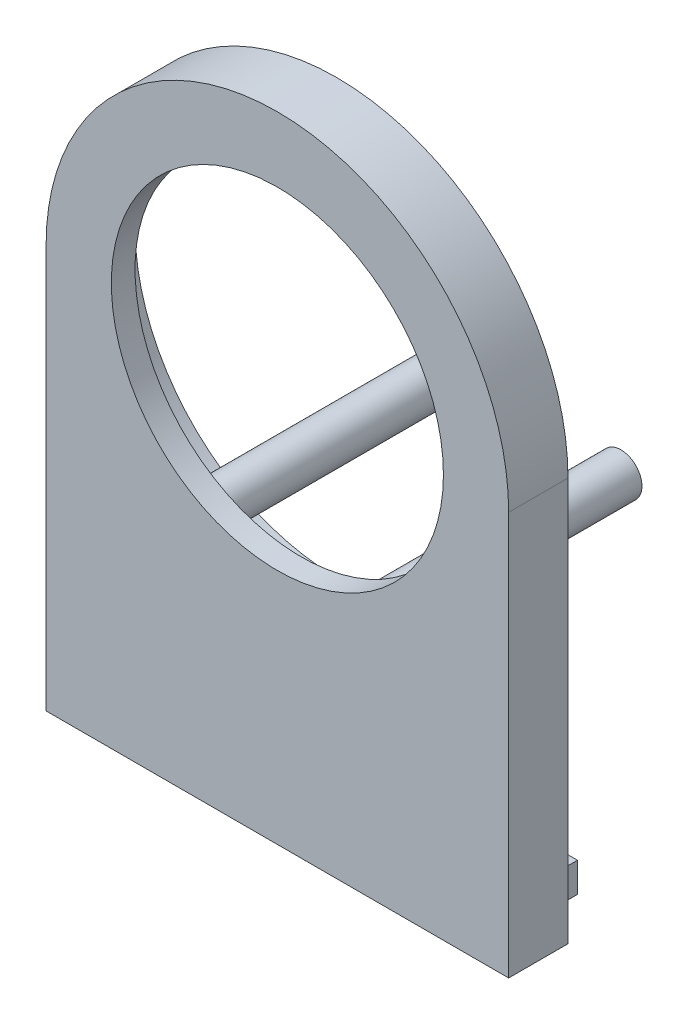
ISO-10303-21;
HEADER;
FILE_DESCRIPTION(('STEP AP214'),'2;1');
FILE_NAME('part.step','',(''),(''),'','','');
FILE_SCHEMA(('AUTOMOTIVE_DESIGN { 1 0 10303 214 1 1 1 1 }'));
ENDSEC;
DATA;
#1=APPLICATION_CONTEXT('core data for automotive mechanical design processes');
#2=APPLICATION_PROTOCOL_DEFINITION('international standard','automotive_design',2000,#1);
#3=PRODUCT_CONTEXT('',#1,'mechanical');
#4=PRODUCT('Part','Part','',(#3));
#5=PRODUCT_RELATED_PRODUCT_CATEGORY('part','',(#4));
#6=PRODUCT_DEFINITION_FORMATION('','',#4);
#7=PRODUCT_DEFINITION_CONTEXT('part definition',#1,'design');
#8=PRODUCT_DEFINITION('design','',#6,#7);
#9=PRODUCT_DEFINITION_SHAPE('','',#8);
#10=(LENGTH_UNIT() NAMED_UNIT(*) SI_UNIT(.MILLI.,.METRE.));
#11=(NAMED_UNIT(*) PLANE_ANGLE_UNIT() SI_UNIT($,.RADIAN.));
#12=(NAMED_UNIT(*) SI_UNIT($,.STERADIAN.) SOLID_ANGLE_UNIT());
#13=UNCERTAINTY_MEASURE_WITH_UNIT(LENGTH_MEASURE(1.E-05),#10,'distance_accuracy_value','');
#14=(GEOMETRIC_REPRESENTATION_CONTEXT(3) GLOBAL_UNCERTAINTY_ASSIGNED_CONTEXT((#13)) GLOBAL_UNIT_ASSIGNED_CONTEXT((#10,
#11,#12)) REPRESENTATION_CONTEXT('',''));
#15=CARTESIAN_POINT('',(0.,0.,0.));
#16=DIRECTION('',(0.,0.,1.));
#17=DIRECTION('',(1.,0.,0.));
#18=AXIS2_PLACEMENT_3D('',#15,#16,#17);
#19=CARTESIAN_POINT('',(0.,0.,-12.7));
#20=DIRECTION('',(0.,0.,1.));
#21=DIRECTION('',(1.,0.,0.));
#22=AXIS2_PLACEMENT_3D('',#19,#20,#21);
#23=CYLINDRICAL_SURFACE('',#22,43.18);
#24=CARTESIAN_POINT('',(0.,0.,-12.7));
#25=DIRECTION('',(0.,0.,1.));
#26=DIRECTION('',(1.,0.,0.));
#27=AXIS2_PLACEMENT_3D('',#24,#25,#26);
#28=CIRCLE('',#27,43.18);
#29=CARTESIAN_POINT('',(-16.7456882368897,-39.8006824749639,-12.7));
#30=VERTEX_POINT('',#29);
#31=CARTESIAN_POINT('',(15.1265083489331,-40.4438023085078,-12.7));
#32=VERTEX_POINT('',#31);
#33=EDGE_CURVE('E64',#30,#32,#28,.T.);
#34=ORIENTED_EDGE('',*,*,#33,.F.);
#35=DIRECTION('',(0.,0.,-1.));
#36=VECTOR('',#35,1.);
#37=CARTESIAN_POINT('',(-16.7456882368897,-39.8006824749638,-29.845));
#38=LINE('',#37,#36);
#39=CARTESIAN_POINT('',(-16.7456882368897,-39.8006824749639,-5.08));
#40=VERTEX_POINT('',#39);
#41=EDGE_CURVE('E11',#30,#40,#38,.F.);
#42=ORIENTED_EDGE('',*,*,#41,.T.);
#43=CARTESIAN_POINT('',(0.,0.,-5.08));
#44=DIRECTION('',(0.,0.,1.));
#45=DIRECTION('',(1.,0.,0.));
#46=AXIS2_PLACEMENT_3D('',#43,#44,#45);
#47=CIRCLE('',#46,43.18);
#48=CARTESIAN_POINT('',(15.1265083489331,-40.4438023085078,-5.08));
#49=VERTEX_POINT('',#48);
#50=EDGE_CURVE('E138',#40,#49,#47,.T.);
#51=ORIENTED_EDGE('',*,*,#50,.T.);
#52=DIRECTION('',(0.,0.,-1.));
#53=VECTOR('',#52,1.);
#54=CARTESIAN_POINT('',(15.1265083489331,-40.4438023085078,-29.845));
#55=LINE('',#54,#53);
#56=EDGE_CURVE('E145',#49,#32,#55,.T.);
#57=ORIENTED_EDGE('',*,*,#56,.T.);
#58=EDGE_LOOP('',(#34,#42,#51,#57));
#59=FACE_BOUND('',#58,.T.);
#60=ADVANCED_FACE('F41',(#59),#23,.F.);
#61=CARTESIAN_POINT('',(0.,0.,-12.7));
#62=DIRECTION('',(0.,0.,1.));
#63=DIRECTION('',(1.,0.,0.));
#64=AXIS2_PLACEMENT_3D('',#61,#62,#63);
#65=PLANE('',#64);
#66=CARTESIAN_POINT('',(22.1824181320942,-37.0466290748961,-12.7));
#67=VERTEX_POINT('',#66);
#68=CARTESIAN_POINT('',(-24.4029508261512,-35.6231440355347,-12.7));
#69=VERTEX_POINT('',#68);
#70=EDGE_CURVE('E166',#67,#69,#28,.T.);
#71=ORIENTED_EDGE('',*,*,#70,.T.);
#72=CARTESIAN_POINT('',(-20.0525315885768,-36.7554966111032,-12.7));
#73=DIRECTION('',(0.,0.,1.));
#74=DIRECTION('',(1.,0.,0.));
#75=AXIS2_PLACEMENT_3D('',#72,#73,#74);
#76=CIRCLE('',#75,4.49537205335151);
#77=EDGE_CURVE('E57',#69,#30,#76,.T.);
#78=ORIENTED_EDGE('',*,*,#77,.T.);
#79=ORIENTED_EDGE('',*,*,#33,.T.);
#80=CARTESIAN_POINT('',(17.6964832477496,-36.7554966111032,-12.7));
#81=DIRECTION('',(0.,0.,1.));
#82=DIRECTION('',(1.,0.,0.));
#83=AXIS2_PLACEMENT_3D('',#80,#81,#82);
#84=CIRCLE('',#83,4.49537205335151);
#85=EDGE_CURVE('E248',#32,#67,#84,.T.);
#86=ORIENTED_EDGE('',*,*,#85,.T.);
#87=EDGE_LOOP('',(#71,#78,#79,#86));
#88=FACE_BOUND('',#87,.T.);
#89=DIRECTION('',(0.,-1.,0.));
#90=VECTOR('',#89,1.);
#91=CARTESIAN_POINT('',(41.402,0.,-12.7));
#92=LINE('',#91,#90);
#93=CARTESIAN_POINT('',(41.402,-80.01,-12.7));
#94=VERTEX_POINT('',#93);
#95=CARTESIAN_POINT('',(41.402,-86.36,-12.7));
#96=VERTEX_POINT('',#95);
#97=EDGE_CURVE('E234',#94,#96,#92,.T.);
#98=ORIENTED_EDGE('',*,*,#97,.F.);
#99=DIRECTION('',(-1.,0.,0.));
#100=VECTOR('',#99,1.);
#101=CARTESIAN_POINT('',(41.402,-80.01,-12.7));
#102=LINE('',#101,#100);
#103=CARTESIAN_POINT('',(-49.53,-80.01,-12.7));
#104=VERTEX_POINT('',#103);
#105=EDGE_CURVE('E220',#94,#104,#102,.T.);
#106=ORIENTED_EDGE('',*,*,#105,.T.);
#107=DIRECTION('',(0.,-1.,0.));
#108=VECTOR('',#107,1.);
#109=CARTESIAN_POINT('',(-49.53,0.,-12.7));
#110=LINE('',#109,#108);
#111=CARTESIAN_POINT('',(-49.53,0.,-12.7));
#112=VERTEX_POINT('',#111);
#113=EDGE_CURVE('E201',#112,#104,#110,.T.);
#114=ORIENTED_EDGE('',*,*,#113,.F.);
#115=CARTESIAN_POINT('',(0.,0.,-12.7));
#116=DIRECTION('',(0.,0.,1.));
#117=DIRECTION('',(1.,0.,0.));
#118=AXIS2_PLACEMENT_3D('',#115,#116,#117);
#119=CIRCLE('',#118,49.53);
#120=CARTESIAN_POINT('',(49.53,0.,-12.7));
#121=VERTEX_POINT('',#120);
#122=EDGE_CURVE('E158',#121,#112,#119,.T.);
#123=ORIENTED_EDGE('',*,*,#122,.F.);
#124=DIRECTION('',(0.,-1.,0.));
#125=VECTOR('',#124,1.);
#126=CARTESIAN_POINT('',(49.53,0.,-12.7));
#127=LINE('',#126,#125);
#128=CARTESIAN_POINT('',(49.53,-86.36,-12.7));
#129=VERTEX_POINT('',#128);
#130=EDGE_CURVE('E208',#121,#129,#127,.T.);
#131=ORIENTED_EDGE('',*,*,#130,.T.);
#132=DIRECTION('',(-1.,0.,0.));
#133=VECTOR('',#132,1.);
#134=CARTESIAN_POINT('',(0.,-86.36,-12.7));
#135=LINE('',#134,#133);
#136=EDGE_CURVE('E213',#129,#96,#135,.T.);
#137=ORIENTED_EDGE('',*,*,#136,.T.);
#138=EDGE_LOOP('',(#98,#106,#114,#123,#131,#137));
#139=FACE_BOUND('',#138,.T.);
#140=ADVANCED_FACE('F288',(#88,#139),#65,.F.);
#141=CARTESIAN_POINT('',(0.,0.,-5.08));
#142=DIRECTION('',(0.,0.,1.));
#143=DIRECTION('',(1.,0.,0.));
#144=AXIS2_PLACEMENT_3D('',#141,#142,#143);
#145=CYLINDRICAL_SURFACE('',#144,35.56);
#146=CARTESIAN_POINT('',(0.,0.,-5.08));
#147=DIRECTION('',(0.,0.,1.));
#148=DIRECTION('',(1.,0.,0.));
#149=AXIS2_PLACEMENT_3D('',#146,#147,#148);
#150=CIRCLE('',#149,35.56);
#151=CARTESIAN_POINT('',(35.56,0.,-5.08));
#152=VERTEX_POINT('',#151);
#153=EDGE_CURVE('E151',#152,#152,#150,.T.);
#154=ORIENTED_EDGE('',*,*,#153,.F.);
#155=EDGE_LOOP('',(#154));
#156=FACE_BOUND('',#155,.T.);
#157=CARTESIAN_POINT('',(0.,0.,0.));
#158=DIRECTION('',(0.,0.,1.));
#159=DIRECTION('',(1.,0.,0.));
#160=AXIS2_PLACEMENT_3D('',#157,#158,#159);
#161=CIRCLE('',#160,35.56);
#162=CARTESIAN_POINT('',(35.56,0.,0.));
#163=VERTEX_POINT('',#162);
#164=EDGE_CURVE('E155',#163,#163,#161,.T.);
#165=ORIENTED_EDGE('',*,*,#164,.T.);
#166=EDGE_LOOP('',(#165));
#167=FACE_BOUND('',#166,.T.);
#168=ADVANCED_FACE('F43',(#156,#167),#145,.F.);
#169=CARTESIAN_POINT('',(0.,0.,-5.08));
#170=DIRECTION('',(0.,0.,1.));
#171=DIRECTION('',(1.,0.,0.));
#172=AXIS2_PLACEMENT_3D('',#169,#170,#171);
#173=PLANE('',#172);
#174=ORIENTED_EDGE('',*,*,#153,.T.);
#175=EDGE_LOOP('',(#174));
#176=FACE_BOUND('',#175,.T.);
#177=ORIENTED_EDGE('',*,*,#50,.F.);
#178=CARTESIAN_POINT('',(-20.0525315885768,-36.7554966111032,-5.08));
#179=DIRECTION('',(0.,0.,1.));
#180=DIRECTION('',(1.,0.,0.));
#181=AXIS2_PLACEMENT_3D('',#178,#179,#180);
#182=CIRCLE('',#181,4.49537205335151);
#183=CARTESIAN_POINT('',(-24.4029508261511,-35.6231440355347,-5.08));
#184=VERTEX_POINT('',#183);
#185=EDGE_CURVE('E125',#40,#184,#182,.T.);
#186=ORIENTED_EDGE('',*,*,#185,.T.);
#187=CARTESIAN_POINT('',(22.1824181320942,-37.0466290748961,-5.08));
#188=VERTEX_POINT('',#187);
#189=EDGE_CURVE('E137',#188,#184,#47,.T.);
#190=ORIENTED_EDGE('',*,*,#189,.F.);
#191=CARTESIAN_POINT('',(17.6964832477496,-36.7554966111032,-5.08));
#192=DIRECTION('',(0.,0.,1.));
#193=DIRECTION('',(1.,0.,0.));
#194=AXIS2_PLACEMENT_3D('',#191,#192,#193);
#195=CIRCLE('',#194,4.49537205335151);
#196=EDGE_CURVE('E261',#188,#49,#195,.T.);
#197=ORIENTED_EDGE('',*,*,#196,.T.);
#198=EDGE_LOOP('',(#177,#186,#190,#197));
#199=FACE_BOUND('',#198,.T.);
#200=ADVANCED_FACE('F135',(#176,#199),#173,.F.);
#201=CARTESIAN_POINT('',(0.,0.,0.));
#202=DIRECTION('',(0.,0.,1.));
#203=DIRECTION('',(1.,0.,0.));
#204=AXIS2_PLACEMENT_3D('',#201,#202,#203);
#205=PLANE('',#204);
#206=ORIENTED_EDGE('',*,*,#164,.F.);
#207=EDGE_LOOP('',(#206));
#208=FACE_BOUND('',#207,.T.);
#209=CARTESIAN_POINT('',(0.,0.,0.));
#210=DIRECTION('',(0.,0.,1.));
#211=DIRECTION('',(1.,0.,0.));
#212=AXIS2_PLACEMENT_3D('',#209,#210,#211);
#213=CIRCLE('',#212,49.53);
#214=CARTESIAN_POINT('',(49.53,0.,0.));
#215=VERTEX_POINT('',#214);
#216=CARTESIAN_POINT('',(-49.53,0.,0.));
#217=VERTEX_POINT('',#216);
#218=EDGE_CURVE('E174',#215,#217,#213,.T.);
#219=ORIENTED_EDGE('',*,*,#218,.T.);
#220=DIRECTION('',(0.,-1.,0.));
#221=VECTOR('',#220,1.);
#222=CARTESIAN_POINT('',(-49.53,0.,0.));
#223=LINE('',#222,#221);
#224=CARTESIAN_POINT('',(-49.53,-86.36,0.));
#225=VERTEX_POINT('',#224);
#226=EDGE_CURVE('E193',#217,#225,#223,.T.);
#227=ORIENTED_EDGE('',*,*,#226,.T.);
#228=DIRECTION('',(-1.,0.,0.));
#229=VECTOR('',#228,1.);
#230=CARTESIAN_POINT('',(0.,-86.36,0.));
#231=LINE('',#230,#229);
#232=CARTESIAN_POINT('',(49.53,-86.36,0.));
#233=VERTEX_POINT('',#232);
#234=EDGE_CURVE('E217',#233,#225,#231,.T.);
#235=ORIENTED_EDGE('',*,*,#234,.F.);
#236=DIRECTION('',(0.,-1.,0.));
#237=VECTOR('',#236,1.);
#238=CARTESIAN_POINT('',(49.53,0.,0.));
#239=LINE('',#238,#237);
#240=EDGE_CURVE('E219',#215,#233,#239,.T.);
#241=ORIENTED_EDGE('',*,*,#240,.F.);
#242=EDGE_LOOP('',(#219,#227,#235,#241));
#243=FACE_BOUND('',#242,.T.);
#244=ADVANCED_FACE('F299',(#208,#243),#205,.T.);
#245=ORIENTED_EDGE('',*,*,#189,.T.);
#246=DIRECTION('',(0.,0.,-1.));
#247=VECTOR('',#246,1.);
#248=CARTESIAN_POINT('',(-24.4029508261511,-35.6231440355347,-29.845));
#249=LINE('',#248,#247);
#250=EDGE_CURVE('E50',#184,#69,#249,.T.);
#251=ORIENTED_EDGE('',*,*,#250,.T.);
#252=ORIENTED_EDGE('',*,*,#70,.F.);
#253=DIRECTION('',(0.,0.,-1.));
#254=VECTOR('',#253,1.);
#255=CARTESIAN_POINT('',(22.1824181320942,-37.0466290748961,-29.845));
#256=LINE('',#255,#254);
#257=EDGE_CURVE('E131',#67,#188,#256,.F.);
#258=ORIENTED_EDGE('',*,*,#257,.T.);
#259=EDGE_LOOP('',(#245,#251,#252,#258));
#260=FACE_BOUND('',#259,.T.);
#261=ADVANCED_FACE('F143',(#260),#23,.F.);
#262=CARTESIAN_POINT('',(0.,0.,-12.7));
#263=DIRECTION('',(0.,0.,1.));
#264=DIRECTION('',(1.,0.,0.));
#265=AXIS2_PLACEMENT_3D('',#262,#263,#264);
#266=CYLINDRICAL_SURFACE('',#265,49.53);
#267=DIRECTION('',(0.,0.,1.));
#268=VECTOR('',#267,1.);
#269=CARTESIAN_POINT('',(-49.53,0.,-12.7));
#270=LINE('',#269,#268);
#271=EDGE_CURVE('E184',#112,#217,#270,.T.);
#272=ORIENTED_EDGE('',*,*,#271,.T.);
#273=ORIENTED_EDGE('',*,*,#218,.F.);
#274=DIRECTION('',(0.,0.,1.));
#275=VECTOR('',#274,1.);
#276=CARTESIAN_POINT('',(49.53,0.,-12.7));
#277=LINE('',#276,#275);
#278=EDGE_CURVE('E190',#121,#215,#277,.T.);
#279=ORIENTED_EDGE('',*,*,#278,.F.);
#280=ORIENTED_EDGE('',*,*,#122,.T.);
#281=EDGE_LOOP('',(#272,#273,#279,#280));
#282=FACE_BOUND('',#281,.T.);
#283=ADVANCED_FACE('F298',(#282),#266,.T.);
#284=CARTESIAN_POINT('',(0.,-86.36,-12.7));
#285=DIRECTION('',(0.,1.,0.));
#286=DIRECTION('',(0.,0.,1.));
#287=AXIS2_PLACEMENT_3D('',#284,#285,#286);
#288=PLANE('',#287);
#289=ORIENTED_EDGE('',*,*,#234,.T.);
#290=DIRECTION('',(0.,0.,1.));
#291=VECTOR('',#290,1.);
#292=CARTESIAN_POINT('',(-49.53,-86.36,-12.7));
#293=LINE('',#292,#291);
#294=CARTESIAN_POINT('',(-49.53,-86.36,-22.86));
#295=VERTEX_POINT('',#294);
#296=EDGE_CURVE('E177',#295,#225,#293,.T.);
#297=ORIENTED_EDGE('',*,*,#296,.F.);
#298=DIRECTION('',(-1.,0.,0.));
#299=VECTOR('',#298,1.);
#300=CARTESIAN_POINT('',(41.402,-86.36,-22.86));
#301=LINE('',#300,#299);
#302=CARTESIAN_POINT('',(41.402,-86.36,-22.86));
#303=VERTEX_POINT('',#302);
#304=EDGE_CURVE('E233',#303,#295,#301,.T.);
#305=ORIENTED_EDGE('',*,*,#304,.F.);
#306=DIRECTION('',(0.,0.,-1.));
#307=VECTOR('',#306,1.);
#308=CARTESIAN_POINT('',(41.402,-86.36,0.));
#309=LINE('',#308,#307);
#310=EDGE_CURVE('E251',#96,#303,#309,.T.);
#311=ORIENTED_EDGE('',*,*,#310,.F.);
#312=ORIENTED_EDGE('',*,*,#136,.F.);
#313=DIRECTION('',(0.,0.,1.));
#314=VECTOR('',#313,1.);
#315=CARTESIAN_POINT('',(49.53,-86.36,-12.7));
#316=LINE('',#315,#314);
#317=EDGE_CURVE('E198',#129,#233,#316,.T.);
#318=ORIENTED_EDGE('',*,*,#317,.T.);
#319=EDGE_LOOP('',(#289,#297,#305,#311,#312,#318));
#320=FACE_BOUND('',#319,.T.);
#321=ADVANCED_FACE('F304',(#320),#288,.F.);
#322=CARTESIAN_POINT('',(-49.53,0.,-12.7));
#323=DIRECTION('',(-1.,0.,0.));
#324=DIRECTION('',(0.,0.,1.));
#325=AXIS2_PLACEMENT_3D('',#322,#323,#324);
#326=PLANE('',#325);
#327=ORIENTED_EDGE('',*,*,#226,.F.);
#328=ORIENTED_EDGE('',*,*,#271,.F.);
#329=ORIENTED_EDGE('',*,*,#113,.T.);
#330=DIRECTION('',(0.,0.,1.));
#331=VECTOR('',#330,1.);
#332=CARTESIAN_POINT('',(-49.53,-80.01,0.));
#333=LINE('',#332,#331);
#334=CARTESIAN_POINT('',(-49.53,-80.01,-22.86));
#335=VERTEX_POINT('',#334);
#336=EDGE_CURVE('E245',#335,#104,#333,.T.);
#337=ORIENTED_EDGE('',*,*,#336,.F.);
#338=DIRECTION('',(0.,1.,0.));
#339=VECTOR('',#338,1.);
#340=CARTESIAN_POINT('',(-49.53,0.,-22.86));
#341=LINE('',#340,#339);
#342=EDGE_CURVE('E241',#295,#335,#341,.T.);
#343=ORIENTED_EDGE('',*,*,#342,.F.);
#344=ORIENTED_EDGE('',*,*,#296,.T.);
#345=EDGE_LOOP('',(#327,#328,#329,#337,#343,#344));
#346=FACE_BOUND('',#345,.T.);
#347=ADVANCED_FACE('F395',(#346),#326,.T.);
#348=CARTESIAN_POINT('',(49.53,0.,-12.7));
#349=DIRECTION('',(-1.,0.,0.));
#350=DIRECTION('',(0.,0.,1.));
#351=AXIS2_PLACEMENT_3D('',#348,#349,#350);
#352=PLANE('',#351);
#353=ORIENTED_EDGE('',*,*,#240,.T.);
#354=ORIENTED_EDGE('',*,*,#317,.F.);
#355=ORIENTED_EDGE('',*,*,#130,.F.);
#356=ORIENTED_EDGE('',*,*,#278,.T.);
#357=EDGE_LOOP('',(#353,#354,#355,#356));
#358=FACE_BOUND('',#357,.T.);
#359=ADVANCED_FACE('F386',(#358),#352,.F.);
#360=CARTESIAN_POINT('',(41.402,-80.01,0.));
#361=DIRECTION('',(0.,-1.,0.));
#362=DIRECTION('',(0.,0.,-1.));
#363=AXIS2_PLACEMENT_3D('',#360,#361,#362);
#364=PLANE('',#363);
#365=ORIENTED_EDGE('',*,*,#336,.T.);
#366=ORIENTED_EDGE('',*,*,#105,.F.);
#367=DIRECTION('',(0.,0.,1.));
#368=VECTOR('',#367,1.);
#369=CARTESIAN_POINT('',(41.402,-80.01,0.));
#370=LINE('',#369,#368);
#371=CARTESIAN_POINT('',(41.402,-80.01,-22.86));
#372=VERTEX_POINT('',#371);
#373=EDGE_CURVE('E244',#372,#94,#370,.T.);
#374=ORIENTED_EDGE('',*,*,#373,.F.);
#375=DIRECTION('',(-1.,0.,0.));
#376=VECTOR('',#375,1.);
#377=CARTESIAN_POINT('',(41.402,-80.01,-22.86));
#378=LINE('',#377,#376);
#379=EDGE_CURVE('E229',#372,#335,#378,.T.);
#380=ORIENTED_EDGE('',*,*,#379,.T.);
#381=EDGE_LOOP('',(#365,#366,#374,#380));
#382=FACE_BOUND('',#381,.T.);
#383=ADVANCED_FACE('F378',(#382),#364,.F.);
#384=CARTESIAN_POINT('',(41.402,0.,-22.86));
#385=DIRECTION('',(0.,0.,1.));
#386=DIRECTION('',(1.,0.,0.));
#387=AXIS2_PLACEMENT_3D('',#384,#385,#386);
#388=PLANE('',#387);
#389=ORIENTED_EDGE('',*,*,#342,.T.);
#390=ORIENTED_EDGE('',*,*,#379,.F.);
#391=DIRECTION('',(0.,1.,0.));
#392=VECTOR('',#391,1.);
#393=CARTESIAN_POINT('',(41.402,0.,-22.86));
#394=LINE('',#393,#392);
#395=EDGE_CURVE('E254',#303,#372,#394,.T.);
#396=ORIENTED_EDGE('',*,*,#395,.F.);
#397=ORIENTED_EDGE('',*,*,#304,.T.);
#398=EDGE_LOOP('',(#389,#390,#396,#397));
#399=FACE_BOUND('',#398,.T.);
#400=ADVANCED_FACE('F370',(#399),#388,.F.);
#401=CARTESIAN_POINT('',(41.402,0.,0.));
#402=DIRECTION('',(-1.,0.,0.));
#403=DIRECTION('',(0.,0.,1.));
#404=AXIS2_PLACEMENT_3D('',#401,#402,#403);
#405=PLANE('',#404);
#406=ORIENTED_EDGE('',*,*,#373,.T.);
#407=ORIENTED_EDGE('',*,*,#97,.T.);
#408=ORIENTED_EDGE('',*,*,#310,.T.);
#409=ORIENTED_EDGE('',*,*,#395,.T.);
#410=EDGE_LOOP('',(#406,#407,#408,#409));
#411=FACE_BOUND('',#410,.T.);
#412=ADVANCED_FACE('F346',(#411),#405,.F.);
#413=CARTESIAN_POINT('',(17.6964832477496,-36.7554966111032,-3.81));
#414=DIRECTION('',(0.,0.,-1.));
#415=DIRECTION('',(-1.,0.,0.));
#416=AXIS2_PLACEMENT_3D('',#413,#414,#415);
#417=CYLINDRICAL_SURFACE('',#416,4.49537205335151);
#418=CARTESIAN_POINT('',(17.6964832477496,-36.7554966111032,-55.88));
#419=DIRECTION('',(0.,0.,-1.));
#420=DIRECTION('',(-1.,0.,0.));
#421=AXIS2_PLACEMENT_3D('',#418,#419,#420);
#422=CIRCLE('',#421,4.49537205335151);
#423=CARTESIAN_POINT('',(13.2011111943981,-36.7554966111032,-55.88));
#424=VERTEX_POINT('',#423);
#425=EDGE_CURVE('E264',#424,#424,#422,.T.);
#426=ORIENTED_EDGE('',*,*,#425,.F.);
#427=EDGE_LOOP('',(#426));
#428=FACE_BOUND('',#427,.T.);
#429=ORIENTED_EDGE('',*,*,#257,.F.);
#430=ORIENTED_EDGE('',*,*,#85,.F.);
#431=ORIENTED_EDGE('',*,*,#56,.F.);
#432=ORIENTED_EDGE('',*,*,#196,.F.);
#433=EDGE_LOOP('',(#429,#430,#431,#432));
#434=FACE_BOUND('',#433,.T.);
#435=ADVANCED_FACE('F284',(#428,#434),#417,.T.);
#436=CARTESIAN_POINT('',(17.6964832477496,-36.7554966111032,-55.88));
#437=DIRECTION('',(0.,0.,-1.));
#438=DIRECTION('',(-1.,0.,0.));
#439=AXIS2_PLACEMENT_3D('',#436,#437,#438);
#440=PLANE('',#439);
#441=ORIENTED_EDGE('',*,*,#425,.T.);
#442=EDGE_LOOP('',(#441));
#443=FACE_BOUND('',#442,.T.);
#444=ADVANCED_FACE('F277',(#443),#440,.T.);
#445=CARTESIAN_POINT('',(-20.0525315885768,-36.7554966111032,-3.81));
#446=DIRECTION('',(0.,0.,-1.));
#447=DIRECTION('',(-1.,0.,0.));
#448=AXIS2_PLACEMENT_3D('',#445,#446,#447);
#449=CYLINDRICAL_SURFACE('',#448,4.49537205335151);
#450=CARTESIAN_POINT('',(-20.0525315885768,-36.7554966111032,-55.88));
#451=DIRECTION('',(0.,0.,-1.));
#452=DIRECTION('',(-1.,0.,0.));
#453=AXIS2_PLACEMENT_3D('',#450,#451,#452);
#454=CIRCLE('',#453,4.49537205335151);
#455=CARTESIAN_POINT('',(-24.5479036419283,-36.7554966111032,-55.88));
#456=VERTEX_POINT('',#455);
#457=EDGE_CURVE('E140',#456,#456,#454,.T.);
#458=ORIENTED_EDGE('',*,*,#457,.F.);
#459=EDGE_LOOP('',(#458));
#460=FACE_BOUND('',#459,.T.);
#461=ORIENTED_EDGE('',*,*,#41,.F.);
#462=ORIENTED_EDGE('',*,*,#77,.F.);
#463=ORIENTED_EDGE('',*,*,#250,.F.);
#464=ORIENTED_EDGE('',*,*,#185,.F.);
#465=EDGE_LOOP('',(#461,#462,#463,#464));
#466=FACE_BOUND('',#465,.T.);
#467=ADVANCED_FACE('F124',(#460,#466),#449,.T.);
#468=CARTESIAN_POINT('',(-20.0525315885768,-36.7554966111032,-55.88));
#469=DIRECTION('',(0.,0.,-1.));
#470=DIRECTION('',(-1.,0.,0.));
#471=AXIS2_PLACEMENT_3D('',#468,#469,#470);
#472=PLANE('',#471);
#473=ORIENTED_EDGE('',*,*,#457,.T.);
#474=EDGE_LOOP('',(#473));
#475=FACE_BOUND('',#474,.T.);
#476=ADVANCED_FACE('F274',(#475),#472,.T.);
#477=CLOSED_SHELL('',(#60,#140,#168,#200,#244,#261,#283,#321,#347,#359,#383,#400,#412,#435,#444,
#467,#476));
#478=MANIFOLD_SOLID_BREP('B2',#477);
#479=ADVANCED_BREP_SHAPE_REPRESENTATION('',(#18,#478),#14);
#480=SHAPE_DEFINITION_REPRESENTATION(#9,#479);
ENDSEC;
END-ISO-10303-21;
